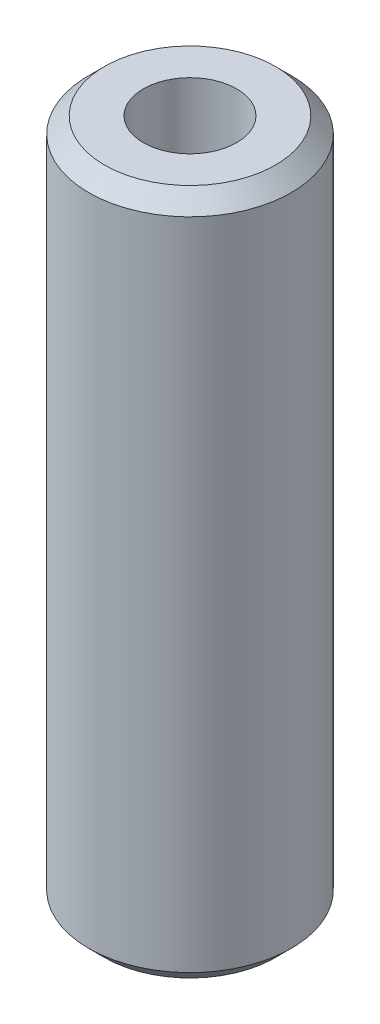
ISO-10303-21;
HEADER;
FILE_DESCRIPTION(('STEP AP214'),'2;1');
FILE_NAME('part.step','',(''),(''),'','','');
FILE_SCHEMA(('AUTOMOTIVE_DESIGN { 1 0 10303 214 1 1 1 1 }'));
ENDSEC;
DATA;
#1=APPLICATION_CONTEXT('core data for automotive mechanical design processes');
#2=APPLICATION_PROTOCOL_DEFINITION('international standard','automotive_design',2000,#1);
#3=PRODUCT_CONTEXT('',#1,'mechanical');
#4=PRODUCT('Part','Part','',(#3));
#5=PRODUCT_RELATED_PRODUCT_CATEGORY('part','',(#4));
#6=PRODUCT_DEFINITION_FORMATION('','',#4);
#7=PRODUCT_DEFINITION_CONTEXT('part definition',#1,'design');
#8=PRODUCT_DEFINITION('design','',#6,#7);
#9=PRODUCT_DEFINITION_SHAPE('','',#8);
#10=(LENGTH_UNIT() NAMED_UNIT(*) SI_UNIT(.MILLI.,.METRE.));
#11=(NAMED_UNIT(*) PLANE_ANGLE_UNIT() SI_UNIT($,.RADIAN.));
#12=(NAMED_UNIT(*) SI_UNIT($,.STERADIAN.) SOLID_ANGLE_UNIT());
#13=UNCERTAINTY_MEASURE_WITH_UNIT(LENGTH_MEASURE(1.E-05),#10,'distance_accuracy_value','');
#14=(GEOMETRIC_REPRESENTATION_CONTEXT(3) GLOBAL_UNCERTAINTY_ASSIGNED_CONTEXT((#13)) GLOBAL_UNIT_ASSIGNED_CONTEXT((#10,
#11,#12)) REPRESENTATION_CONTEXT('',''));
#15=CARTESIAN_POINT('',(0.,0.,0.));
#16=DIRECTION('',(0.,0.,1.));
#17=DIRECTION('',(1.,0.,0.));
#18=AXIS2_PLACEMENT_3D('',#15,#16,#17);
#19=CARTESIAN_POINT('',(0.,236.982157360104,0.));
#20=DIRECTION('',(0.,-1.,0.));
#21=DIRECTION('',(0.,0.,-1.));
#22=AXIS2_PLACEMENT_3D('',#19,#20,#21);
#23=CYLINDRICAL_SURFACE('',#22,35.);
#24=CARTESIAN_POINT('',(0.,231.491837226744,0.));
#25=DIRECTION('',(0.,1.,0.));
#26=DIRECTION('',(0.,0.,1.));
#27=AXIS2_PLACEMENT_3D('',#24,#25,#26);
#28=CIRCLE('',#27,35.);
#29=CARTESIAN_POINT('',(0.,231.491837226744,35.));
#30=VERTEX_POINT('',#29);
#31=EDGE_CURVE('E50',#30,#30,#28,.F.);
#32=ORIENTED_EDGE('',*,*,#31,.T.);
#33=EDGE_LOOP('',(#32));
#34=FACE_BOUND('',#33,.T.);
#35=CARTESIAN_POINT('',(0.,5.49032013335921,0.));
#36=DIRECTION('',(0.,1.,0.));
#37=DIRECTION('',(0.,0.,1.));
#38=AXIS2_PLACEMENT_3D('',#35,#36,#37);
#39=CIRCLE('',#38,35.);
#40=CARTESIAN_POINT('',(0.,5.49032013335921,35.));
#41=VERTEX_POINT('',#40);
#42=EDGE_CURVE('E51',#41,#41,#39,.T.);
#43=ORIENTED_EDGE('',*,*,#42,.T.);
#44=EDGE_LOOP('',(#43));
#45=FACE_BOUND('',#44,.T.);
#46=ADVANCED_FACE('F39',(#34,#45),#23,.T.);
#47=CARTESIAN_POINT('',(0.,236.982157360104,0.));
#48=DIRECTION('',(0.,1.,0.));
#49=DIRECTION('',(0.,0.,1.));
#50=AXIS2_PLACEMENT_3D('',#47,#48,#49);
#51=PLANE('',#50);
#52=CARTESIAN_POINT('',(0.,236.982157360104,0.));
#53=DIRECTION('',(0.,1.,0.));
#54=DIRECTION('',(0.,0.,1.));
#55=AXIS2_PLACEMENT_3D('',#52,#53,#54);
#56=CIRCLE('',#55,29.5096798666408);
#57=CARTESIAN_POINT('',(0.,236.982157360104,29.5096798666408));
#58=VERTEX_POINT('',#57);
#59=EDGE_CURVE('E54',#58,#58,#56,.T.);
#60=ORIENTED_EDGE('',*,*,#59,.T.);
#61=EDGE_LOOP('',(#60));
#62=FACE_BOUND('',#61,.T.);
#63=CARTESIAN_POINT('',(0.,236.982157360104,0.));
#64=DIRECTION('',(0.,1.,0.));
#65=DIRECTION('',(0.,0.,1.));
#66=AXIS2_PLACEMENT_3D('',#63,#64,#65);
#67=CIRCLE('',#66,16.1123014550088);
#68=CARTESIAN_POINT('',(0.,236.982157360104,16.1123014550088));
#69=VERTEX_POINT('',#68);
#70=EDGE_CURVE('E58',#69,#69,#67,.T.);
#71=ORIENTED_EDGE('',*,*,#70,.F.);
#72=EDGE_LOOP('',(#71));
#73=FACE_BOUND('',#72,.T.);
#74=ADVANCED_FACE('F69',(#62,#73),#51,.T.);
#75=CARTESIAN_POINT('',(0.,0.,0.));
#76=DIRECTION('',(0.,1.,0.));
#77=DIRECTION('',(0.,0.,1.));
#78=AXIS2_PLACEMENT_3D('',#75,#76,#77);
#79=PLANE('',#78);
#80=CARTESIAN_POINT('',(0.,0.,0.));
#81=DIRECTION('',(0.,1.,0.));
#82=DIRECTION('',(0.,0.,1.));
#83=AXIS2_PLACEMENT_3D('',#80,#81,#82);
#84=CIRCLE('',#83,29.5096798666407);
#85=CARTESIAN_POINT('',(0.,0.,29.5096798666407));
#86=VERTEX_POINT('',#85);
#87=EDGE_CURVE('E10',#86,#86,#84,.F.);
#88=ORIENTED_EDGE('',*,*,#87,.T.);
#89=EDGE_LOOP('',(#88));
#90=FACE_BOUND('',#89,.T.);
#91=CARTESIAN_POINT('',(0.,0.,0.));
#92=DIRECTION('',(0.,1.,0.));
#93=DIRECTION('',(0.,0.,1.));
#94=AXIS2_PLACEMENT_3D('',#91,#92,#93);
#95=CIRCLE('',#94,16.1123014550088);
#96=CARTESIAN_POINT('',(0.,0.,16.1123014550088));
#97=VERTEX_POINT('',#96);
#98=EDGE_CURVE('E63',#97,#97,#95,.T.);
#99=ORIENTED_EDGE('',*,*,#98,.T.);
#100=EDGE_LOOP('',(#99));
#101=FACE_BOUND('',#100,.T.);
#102=ADVANCED_FACE('F75',(#90,#101),#79,.F.);
#103=CARTESIAN_POINT('',(0.,236.982157360104,0.));
#104=DIRECTION('',(0.,-1.,0.));
#105=DIRECTION('',(0.,0.,-1.));
#106=AXIS2_PLACEMENT_3D('',#103,#104,#105);
#107=CYLINDRICAL_SURFACE('',#106,16.1123014550088);
#108=ORIENTED_EDGE('',*,*,#70,.T.);
#109=EDGE_LOOP('',(#108));
#110=FACE_BOUND('',#109,.T.);
#111=ORIENTED_EDGE('',*,*,#98,.F.);
#112=EDGE_LOOP('',(#111));
#113=FACE_BOUND('',#112,.T.);
#114=ADVANCED_FACE('F70',(#110,#113),#107,.F.);
#115=CARTESIAN_POINT('',(0.,236.982157360104,0.));
#116=DIRECTION('',(0.,-1.,0.));
#117=DIRECTION('',(0.,0.,-1.));
#118=AXIS2_PLACEMENT_3D('',#115,#116,#117);
#119=CONICAL_SURFACE('',#118,29.5096798666408,0.785398163397444);
#120=ORIENTED_EDGE('',*,*,#31,.F.);
#121=EDGE_LOOP('',(#120));
#122=FACE_BOUND('',#121,.T.);
#123=ORIENTED_EDGE('',*,*,#59,.F.);
#124=EDGE_LOOP('',(#123));
#125=FACE_BOUND('',#124,.T.);
#126=ADVANCED_FACE('F81',(#122,#125),#119,.T.);
#127=CARTESIAN_POINT('',(0.,5.49032013335921,0.));
#128=DIRECTION('',(0.,1.,0.));
#129=DIRECTION('',(0.,0.,1.));
#130=AXIS2_PLACEMENT_3D('',#127,#128,#129);
#131=CONICAL_SURFACE('',#130,35.,0.785398163397454);
#132=ORIENTED_EDGE('',*,*,#87,.F.);
#133=EDGE_LOOP('',(#132));
#134=FACE_BOUND('',#133,.T.);
#135=ORIENTED_EDGE('',*,*,#42,.F.);
#136=EDGE_LOOP('',(#135));
#137=FACE_BOUND('',#136,.T.);
#138=ADVANCED_FACE('F45',(#134,#137),#131,.T.);
#139=CLOSED_SHELL('',(#46,#74,#102,#114,#126,#138));
#140=MANIFOLD_SOLID_BREP('B2',#139);
#141=ADVANCED_BREP_SHAPE_REPRESENTATION('',(#18,#140),#14);
#142=SHAPE_DEFINITION_REPRESENTATION(#9,#141);
ENDSEC;
END-ISO-10303-21;
